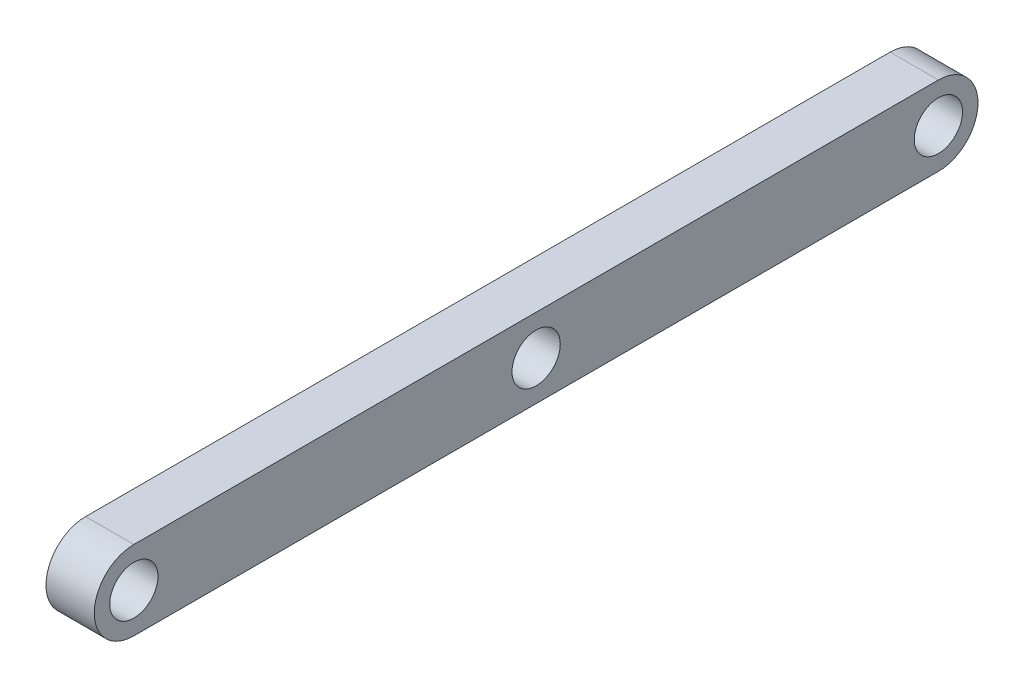
ISO-10303-21;
HEADER;
FILE_DESCRIPTION(('STEP AP214'),'2;1');
FILE_NAME('part.step','',(''),(''),'','','');
FILE_SCHEMA(('AUTOMOTIVE_DESIGN { 1 0 10303 214 1 1 1 1 }'));
ENDSEC;
DATA;
#1=APPLICATION_CONTEXT('core data for automotive mechanical design processes');
#2=APPLICATION_PROTOCOL_DEFINITION('international standard','automotive_design',2000,#1);
#3=PRODUCT_CONTEXT('',#1,'mechanical');
#4=PRODUCT('Part','Part','',(#3));
#5=PRODUCT_RELATED_PRODUCT_CATEGORY('part','',(#4));
#6=PRODUCT_DEFINITION_FORMATION('','',#4);
#7=PRODUCT_DEFINITION_CONTEXT('part definition',#1,'design');
#8=PRODUCT_DEFINITION('design','',#6,#7);
#9=PRODUCT_DEFINITION_SHAPE('','',#8);
#10=(LENGTH_UNIT() NAMED_UNIT(*) SI_UNIT(.MILLI.,.METRE.));
#11=(NAMED_UNIT(*) PLANE_ANGLE_UNIT() SI_UNIT($,.RADIAN.));
#12=(NAMED_UNIT(*) SI_UNIT($,.STERADIAN.) SOLID_ANGLE_UNIT());
#13=UNCERTAINTY_MEASURE_WITH_UNIT(LENGTH_MEASURE(1.E-05),#10,'distance_accuracy_value','');
#14=(GEOMETRIC_REPRESENTATION_CONTEXT(3) GLOBAL_UNCERTAINTY_ASSIGNED_CONTEXT((#13)) GLOBAL_UNIT_ASSIGNED_CONTEXT((#10,
#11,#12)) REPRESENTATION_CONTEXT('',''));
#15=CARTESIAN_POINT('',(0.,0.,0.));
#16=DIRECTION('',(0.,0.,1.));
#17=DIRECTION('',(1.,0.,0.));
#18=AXIS2_PLACEMENT_3D('',#15,#16,#17);
#19=CARTESIAN_POINT('',(30.,0.,48.8785666887857));
#20=DIRECTION('',(1.,0.,0.));
#21=DIRECTION('',(0.,0.,-1.));
#22=AXIS2_PLACEMENT_3D('',#19,#20,#21);
#23=PLANE('',#22);
#24=CARTESIAN_POINT('',(30.,0.,-451.121433311214));
#25=DIRECTION('',(1.,0.,0.));
#26=DIRECTION('',(0.,0.,-1.));
#27=AXIS2_PLACEMENT_3D('',#24,#25,#26);
#28=CIRCLE('',#27,15.);
#29=CARTESIAN_POINT('',(30.,0.,-466.121433311214));
#30=VERTEX_POINT('',#29);
#31=EDGE_CURVE('E115',#30,#30,#28,.T.);
#32=ORIENTED_EDGE('',*,*,#31,.F.);
#33=EDGE_LOOP('',(#32));
#34=FACE_BOUND('',#33,.T.);
#35=CARTESIAN_POINT('',(30.,0.,48.8785666887857));
#36=DIRECTION('',(1.,0.,0.));
#37=DIRECTION('',(0.,0.,-1.));
#38=AXIS2_PLACEMENT_3D('',#35,#36,#37);
#39=CIRCLE('',#38,24.6078301260783);
#40=CARTESIAN_POINT('',(30.,24.6078301260783,48.8785666887857));
#41=VERTEX_POINT('',#40);
#42=CARTESIAN_POINT('',(30.,-24.6078301260783,48.8785666887857));
#43=VERTEX_POINT('',#42);
#44=EDGE_CURVE('E85',#41,#43,#39,.T.);
#45=ORIENTED_EDGE('',*,*,#44,.T.);
#46=DIRECTION('',(0.,0.,-1.));
#47=VECTOR('',#46,1.);
#48=CARTESIAN_POINT('',(30.,-24.6078301260783,48.8785666887857));
#49=LINE('',#48,#47);
#50=CARTESIAN_POINT('',(30.,-24.6078301260783,-451.121433311214));
#51=VERTEX_POINT('',#50);
#52=EDGE_CURVE('E80',#43,#51,#49,.T.);
#53=ORIENTED_EDGE('',*,*,#52,.T.);
#54=CARTESIAN_POINT('',(30.,0.,-451.121433311214));
#55=DIRECTION('',(1.,0.,0.));
#56=DIRECTION('',(0.,0.,-1.));
#57=AXIS2_PLACEMENT_3D('',#54,#55,#56);
#58=CIRCLE('',#57,24.6078301260783);
#59=CARTESIAN_POINT('',(30.,24.6078301260783,-451.121433311214));
#60=VERTEX_POINT('',#59);
#61=EDGE_CURVE('E83',#51,#60,#58,.T.);
#62=ORIENTED_EDGE('',*,*,#61,.T.);
#63=DIRECTION('',(0.,0.,1.));
#64=VECTOR('',#63,1.);
#65=CARTESIAN_POINT('',(30.,24.6078301260783,48.8785666887857));
#66=LINE('',#65,#64);
#67=EDGE_CURVE('E50',#60,#41,#66,.T.);
#68=ORIENTED_EDGE('',*,*,#67,.T.);
#69=EDGE_LOOP('',(#45,#53,#62,#68));
#70=FACE_BOUND('',#69,.T.);
#71=CARTESIAN_POINT('',(30.,0.,48.8785666887857));
#72=DIRECTION('',(1.,0.,0.));
#73=DIRECTION('',(0.,0.,-1.));
#74=AXIS2_PLACEMENT_3D('',#71,#72,#73);
#75=CIRCLE('',#74,15.);
#76=CARTESIAN_POINT('',(30.,0.,33.8785666887857));
#77=VERTEX_POINT('',#76);
#78=EDGE_CURVE('E100',#77,#77,#75,.T.);
#79=ORIENTED_EDGE('',*,*,#78,.F.);
#80=EDGE_LOOP('',(#79));
#81=FACE_BOUND('',#80,.T.);
#82=CARTESIAN_POINT('',(30.,0.,-201.121433311214));
#83=DIRECTION('',(1.,0.,0.));
#84=DIRECTION('',(0.,0.,-1.));
#85=AXIS2_PLACEMENT_3D('',#82,#83,#84);
#86=CIRCLE('',#85,15.);
#87=CARTESIAN_POINT('',(30.,0.,-216.121433311214));
#88=VERTEX_POINT('',#87);
#89=EDGE_CURVE('E121',#88,#88,#86,.T.);
#90=ORIENTED_EDGE('',*,*,#89,.F.);
#91=EDGE_LOOP('',(#90));
#92=FACE_BOUND('',#91,.T.);
#93=ADVANCED_FACE('F33',(#34,#70,#81,#92),#23,.T.);
#94=CARTESIAN_POINT('',(0.,0.,48.8785666887857));
#95=DIRECTION('',(1.,0.,0.));
#96=DIRECTION('',(0.,0.,-1.));
#97=AXIS2_PLACEMENT_3D('',#94,#95,#96);
#98=PLANE('',#97);
#99=CARTESIAN_POINT('',(0.,0.,-451.121433311214));
#100=DIRECTION('',(1.,0.,0.));
#101=DIRECTION('',(0.,0.,-1.));
#102=AXIS2_PLACEMENT_3D('',#99,#100,#101);
#103=CIRCLE('',#102,15.);
#104=CARTESIAN_POINT('',(0.,0.,-466.121433311214));
#105=VERTEX_POINT('',#104);
#106=EDGE_CURVE('E118',#105,#105,#103,.T.);
#107=ORIENTED_EDGE('',*,*,#106,.T.);
#108=EDGE_LOOP('',(#107));
#109=FACE_BOUND('',#108,.T.);
#110=CARTESIAN_POINT('',(0.,0.,48.8785666887857));
#111=DIRECTION('',(1.,0.,0.));
#112=DIRECTION('',(0.,0.,-1.));
#113=AXIS2_PLACEMENT_3D('',#110,#111,#112);
#114=CIRCLE('',#113,24.6078301260783);
#115=CARTESIAN_POINT('',(0.,24.6078301260783,48.8785666887857));
#116=VERTEX_POINT('',#115);
#117=CARTESIAN_POINT('',(0.,-24.6078301260783,48.8785666887857));
#118=VERTEX_POINT('',#117);
#119=EDGE_CURVE('E97',#116,#118,#114,.T.);
#120=ORIENTED_EDGE('',*,*,#119,.F.);
#121=DIRECTION('',(0.,0.,1.));
#122=VECTOR('',#121,1.);
#123=CARTESIAN_POINT('',(0.,24.6078301260783,48.8785666887857));
#124=LINE('',#123,#122);
#125=CARTESIAN_POINT('',(0.,24.6078301260783,-451.121433311214));
#126=VERTEX_POINT('',#125);
#127=EDGE_CURVE('E73',#126,#116,#124,.T.);
#128=ORIENTED_EDGE('',*,*,#127,.F.);
#129=CARTESIAN_POINT('',(0.,0.,-451.121433311214));
#130=DIRECTION('',(1.,0.,0.));
#131=DIRECTION('',(0.,0.,-1.));
#132=AXIS2_PLACEMENT_3D('',#129,#130,#131);
#133=CIRCLE('',#132,24.6078301260783);
#134=CARTESIAN_POINT('',(0.,-24.6078301260783,-451.121433311214));
#135=VERTEX_POINT('',#134);
#136=EDGE_CURVE('E67',#135,#126,#133,.T.);
#137=ORIENTED_EDGE('',*,*,#136,.F.);
#138=DIRECTION('',(0.,0.,-1.));
#139=VECTOR('',#138,1.);
#140=CARTESIAN_POINT('',(0.,-24.6078301260783,48.8785666887857));
#141=LINE('',#140,#139);
#142=EDGE_CURVE('E89',#118,#135,#141,.T.);
#143=ORIENTED_EDGE('',*,*,#142,.F.);
#144=EDGE_LOOP('',(#120,#128,#137,#143));
#145=FACE_BOUND('',#144,.T.);
#146=CARTESIAN_POINT('',(0.,0.,48.8785666887857));
#147=DIRECTION('',(1.,0.,0.));
#148=DIRECTION('',(0.,0.,-1.));
#149=AXIS2_PLACEMENT_3D('',#146,#147,#148);
#150=CIRCLE('',#149,15.);
#151=CARTESIAN_POINT('',(0.,0.,33.8785666887857));
#152=VERTEX_POINT('',#151);
#153=EDGE_CURVE('E112',#152,#152,#150,.T.);
#154=ORIENTED_EDGE('',*,*,#153,.T.);
#155=EDGE_LOOP('',(#154));
#156=FACE_BOUND('',#155,.T.);
#157=CARTESIAN_POINT('',(0.,0.,-201.121433311214));
#158=DIRECTION('',(1.,0.,0.));
#159=DIRECTION('',(0.,0.,-1.));
#160=AXIS2_PLACEMENT_3D('',#157,#158,#159);
#161=CIRCLE('',#160,15.);
#162=CARTESIAN_POINT('',(0.,0.,-216.121433311214));
#163=VERTEX_POINT('',#162);
#164=EDGE_CURVE('E124',#163,#163,#161,.T.);
#165=ORIENTED_EDGE('',*,*,#164,.T.);
#166=EDGE_LOOP('',(#165));
#167=FACE_BOUND('',#166,.T.);
#168=ADVANCED_FACE('F108',(#109,#145,#156,#167),#98,.F.);
#169=CARTESIAN_POINT('',(30.,0.,48.8785666887857));
#170=DIRECTION('',(-1.,0.,0.));
#171=DIRECTION('',(0.,0.,1.));
#172=AXIS2_PLACEMENT_3D('',#169,#170,#171);
#173=CYLINDRICAL_SURFACE('',#172,24.6078301260783);
#174=ORIENTED_EDGE('',*,*,#119,.T.);
#175=DIRECTION('',(-1.,0.,0.));
#176=VECTOR('',#175,1.);
#177=CARTESIAN_POINT('',(30.,-24.6078301260783,48.8785666887857));
#178=LINE('',#177,#176);
#179=EDGE_CURVE('E11',#43,#118,#178,.T.);
#180=ORIENTED_EDGE('',*,*,#179,.F.);
#181=ORIENTED_EDGE('',*,*,#44,.F.);
#182=DIRECTION('',(-1.,0.,0.));
#183=VECTOR('',#182,1.);
#184=CARTESIAN_POINT('',(30.,24.6078301260783,48.8785666887857));
#185=LINE('',#184,#183);
#186=EDGE_CURVE('E93',#41,#116,#185,.T.);
#187=ORIENTED_EDGE('',*,*,#186,.T.);
#188=EDGE_LOOP('',(#174,#180,#181,#187));
#189=FACE_BOUND('',#188,.T.);
#190=ADVANCED_FACE('F35',(#189),#173,.T.);
#191=CARTESIAN_POINT('',(30.,-24.6078301260783,48.8785666887857));
#192=DIRECTION('',(0.,1.,0.));
#193=DIRECTION('',(0.,0.,1.));
#194=AXIS2_PLACEMENT_3D('',#191,#192,#193);
#195=PLANE('',#194);
#196=ORIENTED_EDGE('',*,*,#142,.T.);
#197=DIRECTION('',(-1.,0.,0.));
#198=VECTOR('',#197,1.);
#199=CARTESIAN_POINT('',(30.,-24.6078301260783,-451.121433311214));
#200=LINE('',#199,#198);
#201=EDGE_CURVE('E42',#51,#135,#200,.T.);
#202=ORIENTED_EDGE('',*,*,#201,.F.);
#203=ORIENTED_EDGE('',*,*,#52,.F.);
#204=ORIENTED_EDGE('',*,*,#179,.T.);
#205=EDGE_LOOP('',(#196,#202,#203,#204));
#206=FACE_BOUND('',#205,.T.);
#207=ADVANCED_FACE('F88',(#206),#195,.F.);
#208=CARTESIAN_POINT('',(30.,0.,-451.121433311214));
#209=DIRECTION('',(-1.,0.,0.));
#210=DIRECTION('',(0.,0.,1.));
#211=AXIS2_PLACEMENT_3D('',#208,#209,#210);
#212=CYLINDRICAL_SURFACE('',#211,24.6078301260783);
#213=ORIENTED_EDGE('',*,*,#136,.T.);
#214=DIRECTION('',(-1.,0.,0.));
#215=VECTOR('',#214,1.);
#216=CARTESIAN_POINT('',(30.,24.6078301260783,-451.121433311214));
#217=LINE('',#216,#215);
#218=EDGE_CURVE('E90',#60,#126,#217,.T.);
#219=ORIENTED_EDGE('',*,*,#218,.F.);
#220=ORIENTED_EDGE('',*,*,#61,.F.);
#221=ORIENTED_EDGE('',*,*,#201,.T.);
#222=EDGE_LOOP('',(#213,#219,#220,#221));
#223=FACE_BOUND('',#222,.T.);
#224=ADVANCED_FACE('F91',(#223),#212,.T.);
#225=CARTESIAN_POINT('',(30.,24.6078301260783,48.8785666887857));
#226=DIRECTION('',(0.,-1.,0.));
#227=DIRECTION('',(0.,0.,-1.));
#228=AXIS2_PLACEMENT_3D('',#225,#226,#227);
#229=PLANE('',#228);
#230=ORIENTED_EDGE('',*,*,#127,.T.);
#231=ORIENTED_EDGE('',*,*,#186,.F.);
#232=ORIENTED_EDGE('',*,*,#67,.F.);
#233=ORIENTED_EDGE('',*,*,#218,.T.);
#234=EDGE_LOOP('',(#230,#231,#232,#233));
#235=FACE_BOUND('',#234,.T.);
#236=ADVANCED_FACE('F105',(#235),#229,.F.);
#237=CARTESIAN_POINT('',(30.,0.,48.8785666887857));
#238=DIRECTION('',(-1.,0.,0.));
#239=DIRECTION('',(0.,0.,1.));
#240=AXIS2_PLACEMENT_3D('',#237,#238,#239);
#241=CYLINDRICAL_SURFACE('',#240,15.);
#242=ORIENTED_EDGE('',*,*,#78,.T.);
#243=EDGE_LOOP('',(#242));
#244=FACE_BOUND('',#243,.T.);
#245=ORIENTED_EDGE('',*,*,#153,.F.);
#246=EDGE_LOOP('',(#245));
#247=FACE_BOUND('',#246,.T.);
#248=ADVANCED_FACE('F143',(#244,#247),#241,.F.);
#249=CARTESIAN_POINT('',(30.,0.,-451.121433311214));
#250=DIRECTION('',(-1.,0.,0.));
#251=DIRECTION('',(0.,0.,1.));
#252=AXIS2_PLACEMENT_3D('',#249,#250,#251);
#253=CYLINDRICAL_SURFACE('',#252,15.);
#254=ORIENTED_EDGE('',*,*,#31,.T.);
#255=EDGE_LOOP('',(#254));
#256=FACE_BOUND('',#255,.T.);
#257=ORIENTED_EDGE('',*,*,#106,.F.);
#258=EDGE_LOOP('',(#257));
#259=FACE_BOUND('',#258,.T.);
#260=ADVANCED_FACE('F189',(#256,#259),#253,.F.);
#261=CARTESIAN_POINT('',(30.,0.,-201.121433311214));
#262=DIRECTION('',(-1.,0.,0.));
#263=DIRECTION('',(0.,0.,1.));
#264=AXIS2_PLACEMENT_3D('',#261,#262,#263);
#265=CYLINDRICAL_SURFACE('',#264,15.);
#266=ORIENTED_EDGE('',*,*,#89,.T.);
#267=EDGE_LOOP('',(#266));
#268=FACE_BOUND('',#267,.T.);
#269=ORIENTED_EDGE('',*,*,#164,.F.);
#270=EDGE_LOOP('',(#269));
#271=FACE_BOUND('',#270,.T.);
#272=ADVANCED_FACE('F130',(#268,#271),#265,.F.);
#273=CLOSED_SHELL('',(#93,#168,#190,#207,#224,#236,#248,#260,#272));
#274=MANIFOLD_SOLID_BREP('B2',#273);
#275=ADVANCED_BREP_SHAPE_REPRESENTATION('',(#18,#274),#14);
#276=SHAPE_DEFINITION_REPRESENTATION(#9,#275);
ENDSEC;
END-ISO-10303-21;
